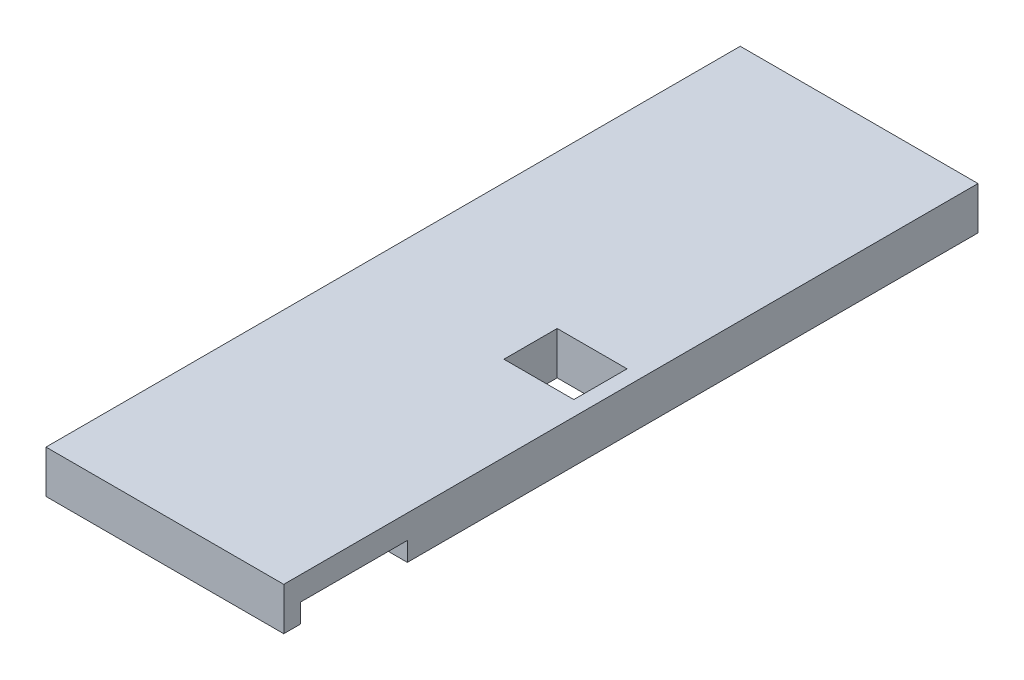
ISO-10303-21;
HEADER;
FILE_DESCRIPTION(('STEP AP214'),'2;1');
FILE_NAME('part.step','',(''),(''),'','','');
FILE_SCHEMA(('AUTOMOTIVE_DESIGN { 1 0 10303 214 1 1 1 1 }'));
ENDSEC;
DATA;
#1=APPLICATION_CONTEXT('core data for automotive mechanical design processes');
#2=APPLICATION_PROTOCOL_DEFINITION('international standard','automotive_design',2000,#1);
#3=PRODUCT_CONTEXT('',#1,'mechanical');
#4=PRODUCT('Part','Part','',(#3));
#5=PRODUCT_RELATED_PRODUCT_CATEGORY('part','',(#4));
#6=PRODUCT_DEFINITION_FORMATION('','',#4);
#7=PRODUCT_DEFINITION_CONTEXT('part definition',#1,'design');
#8=PRODUCT_DEFINITION('design','',#6,#7);
#9=PRODUCT_DEFINITION_SHAPE('','',#8);
#10=(LENGTH_UNIT() NAMED_UNIT(*) SI_UNIT(.MILLI.,.METRE.));
#11=(NAMED_UNIT(*) PLANE_ANGLE_UNIT() SI_UNIT($,.RADIAN.));
#12=(NAMED_UNIT(*) SI_UNIT($,.STERADIAN.) SOLID_ANGLE_UNIT());
#13=UNCERTAINTY_MEASURE_WITH_UNIT(LENGTH_MEASURE(1.E-05),#10,'distance_accuracy_value','');
#14=(GEOMETRIC_REPRESENTATION_CONTEXT(3) GLOBAL_UNCERTAINTY_ASSIGNED_CONTEXT((#13)) GLOBAL_UNIT_ASSIGNED_CONTEXT((#10,
#11,#12)) REPRESENTATION_CONTEXT('',''));
#15=CARTESIAN_POINT('',(0.,0.,0.));
#16=DIRECTION('',(0.,0.,1.));
#17=DIRECTION('',(1.,0.,0.));
#18=AXIS2_PLACEMENT_3D('',#15,#16,#17);
#19=CARTESIAN_POINT('',(50.,9.,146.));
#20=DIRECTION('',(-1.,0.,0.));
#21=DIRECTION('',(0.,0.,1.));
#22=AXIS2_PLACEMENT_3D('',#19,#20,#21);
#23=PLANE('',#22);
#24=DIRECTION('',(0.,0.,-1.));
#25=VECTOR('',#24,1.);
#26=CARTESIAN_POINT('',(50.,-9.,146.));
#27=LINE('',#26,#25);
#28=CARTESIAN_POINT('',(50.,-9.,146.));
#29=VERTEX_POINT('',#28);
#30=CARTESIAN_POINT('',(50.,-9.,139.021105826968));
#31=VERTEX_POINT('',#30);
#32=EDGE_CURVE('E203',#29,#31,#27,.T.);
#33=ORIENTED_EDGE('',*,*,#32,.T.);
#34=DIRECTION('',(0.,-1.,0.));
#35=VECTOR('',#34,1.);
#36=CARTESIAN_POINT('',(50.,-0.999999999999999,139.021105826968));
#37=LINE('',#36,#35);
#38=CARTESIAN_POINT('',(50.,-0.999999999999999,139.021105826968));
#39=VERTEX_POINT('',#38);
#40=EDGE_CURVE('E159',#39,#31,#37,.T.);
#41=ORIENTED_EDGE('',*,*,#40,.F.);
#42=DIRECTION('',(0.,0.,1.));
#43=VECTOR('',#42,1.);
#44=CARTESIAN_POINT('',(50.,-0.999999999999999,94.0211058269679));
#45=LINE('',#44,#43);
#46=CARTESIAN_POINT('',(50.,-0.999999999999999,94.0211058269679));
#47=VERTEX_POINT('',#46);
#48=EDGE_CURVE('E142',#47,#39,#45,.T.);
#49=ORIENTED_EDGE('',*,*,#48,.F.);
#50=DIRECTION('',(0.,-1.,0.));
#51=VECTOR('',#50,1.);
#52=CARTESIAN_POINT('',(50.,-0.999999999999999,94.0211058269679));
#53=LINE('',#52,#51);
#54=CARTESIAN_POINT('',(50.,-9.,94.0211058269679));
#55=VERTEX_POINT('',#54);
#56=EDGE_CURVE('E133',#47,#55,#53,.T.);
#57=ORIENTED_EDGE('',*,*,#56,.T.);
#58=CARTESIAN_POINT('',(50.,-9.,-146.));
#59=VERTEX_POINT('',#58);
#60=EDGE_CURVE('E185',#55,#59,#27,.T.);
#61=ORIENTED_EDGE('',*,*,#60,.T.);
#62=DIRECTION('',(0.,-1.,0.));
#63=VECTOR('',#62,1.);
#64=CARTESIAN_POINT('',(50.,9.,-146.));
#65=LINE('',#64,#63);
#66=CARTESIAN_POINT('',(50.,9.,-146.));
#67=VERTEX_POINT('',#66);
#68=EDGE_CURVE('E11',#67,#59,#65,.T.);
#69=ORIENTED_EDGE('',*,*,#68,.F.);
#70=DIRECTION('',(0.,0.,-1.));
#71=VECTOR('',#70,1.);
#72=CARTESIAN_POINT('',(50.,9.,146.));
#73=LINE('',#72,#71);
#74=CARTESIAN_POINT('',(50.,9.,146.));
#75=VERTEX_POINT('',#74);
#76=EDGE_CURVE('E192',#75,#67,#73,.T.);
#77=ORIENTED_EDGE('',*,*,#76,.F.);
#78=DIRECTION('',(0.,-1.,0.));
#79=VECTOR('',#78,1.);
#80=CARTESIAN_POINT('',(50.,9.,146.));
#81=LINE('',#80,#79);
#82=EDGE_CURVE('E202',#75,#29,#81,.T.);
#83=ORIENTED_EDGE('',*,*,#82,.T.);
#84=EDGE_LOOP('',(#33,#41,#49,#57,#61,#69,#77,#83));
#85=FACE_BOUND('',#84,.T.);
#86=ADVANCED_FACE('F39',(#85),#23,.F.);
#87=CARTESIAN_POINT('',(-50.,9.,-146.));
#88=DIRECTION('',(0.,0.,1.));
#89=DIRECTION('',(1.,0.,0.));
#90=AXIS2_PLACEMENT_3D('',#87,#88,#89);
#91=PLANE('',#90);
#92=DIRECTION('',(-1.,0.,0.));
#93=VECTOR('',#92,1.);
#94=CARTESIAN_POINT('',(-50.,-9.,-146.));
#95=LINE('',#94,#93);
#96=CARTESIAN_POINT('',(-50.,-9.,-146.));
#97=VERTEX_POINT('',#96);
#98=EDGE_CURVE('E206',#59,#97,#95,.T.);
#99=ORIENTED_EDGE('',*,*,#98,.T.);
#100=DIRECTION('',(0.,-1.,0.));
#101=VECTOR('',#100,1.);
#102=CARTESIAN_POINT('',(-50.,9.,-146.));
#103=LINE('',#102,#101);
#104=CARTESIAN_POINT('',(-50.,9.,-146.));
#105=VERTEX_POINT('',#104);
#106=EDGE_CURVE('E46',#105,#97,#103,.T.);
#107=ORIENTED_EDGE('',*,*,#106,.F.);
#108=DIRECTION('',(-1.,0.,0.));
#109=VECTOR('',#108,1.);
#110=CARTESIAN_POINT('',(-50.,9.,-146.));
#111=LINE('',#110,#109);
#112=EDGE_CURVE('E195',#67,#105,#111,.T.);
#113=ORIENTED_EDGE('',*,*,#112,.F.);
#114=ORIENTED_EDGE('',*,*,#68,.T.);
#115=EDGE_LOOP('',(#99,#107,#113,#114));
#116=FACE_BOUND('',#115,.T.);
#117=ADVANCED_FACE('F241',(#116),#91,.F.);
#118=CARTESIAN_POINT('',(-50.,9.,146.));
#119=DIRECTION('',(1.,0.,0.));
#120=DIRECTION('',(0.,0.,-1.));
#121=AXIS2_PLACEMENT_3D('',#118,#119,#120);
#122=PLANE('',#121);
#123=DIRECTION('',(0.,0.,1.));
#124=VECTOR('',#123,1.);
#125=CARTESIAN_POINT('',(-50.,-9.,146.));
#126=LINE('',#125,#124);
#127=CARTESIAN_POINT('',(-50.,-9.,146.));
#128=VERTEX_POINT('',#127);
#129=EDGE_CURVE('E208',#97,#128,#126,.T.);
#130=ORIENTED_EDGE('',*,*,#129,.T.);
#131=DIRECTION('',(0.,-1.,0.));
#132=VECTOR('',#131,1.);
#133=CARTESIAN_POINT('',(-50.,9.,146.));
#134=LINE('',#133,#132);
#135=CARTESIAN_POINT('',(-50.,9.,146.));
#136=VERTEX_POINT('',#135);
#137=EDGE_CURVE('E213',#136,#128,#134,.T.);
#138=ORIENTED_EDGE('',*,*,#137,.F.);
#139=DIRECTION('',(0.,0.,1.));
#140=VECTOR('',#139,1.);
#141=CARTESIAN_POINT('',(-50.,9.,146.));
#142=LINE('',#141,#140);
#143=EDGE_CURVE('E198',#105,#136,#142,.T.);
#144=ORIENTED_EDGE('',*,*,#143,.F.);
#145=ORIENTED_EDGE('',*,*,#106,.T.);
#146=EDGE_LOOP('',(#130,#138,#144,#145));
#147=FACE_BOUND('',#146,.T.);
#148=ADVANCED_FACE('F220',(#147),#122,.F.);
#149=CARTESIAN_POINT('',(-50.,9.,146.));
#150=DIRECTION('',(0.,0.,-1.));
#151=DIRECTION('',(-1.,0.,0.));
#152=AXIS2_PLACEMENT_3D('',#149,#150,#151);
#153=PLANE('',#152);
#154=DIRECTION('',(1.,0.,0.));
#155=VECTOR('',#154,1.);
#156=CARTESIAN_POINT('',(-50.,-9.,146.));
#157=LINE('',#156,#155);
#158=EDGE_CURVE('E196',#128,#29,#157,.T.);
#159=ORIENTED_EDGE('',*,*,#158,.T.);
#160=ORIENTED_EDGE('',*,*,#82,.F.);
#161=DIRECTION('',(1.,0.,0.));
#162=VECTOR('',#161,1.);
#163=CARTESIAN_POINT('',(-50.,9.,146.));
#164=LINE('',#163,#162);
#165=EDGE_CURVE('E200',#136,#75,#164,.T.);
#166=ORIENTED_EDGE('',*,*,#165,.F.);
#167=ORIENTED_EDGE('',*,*,#137,.T.);
#168=EDGE_LOOP('',(#159,#160,#166,#167));
#169=FACE_BOUND('',#168,.T.);
#170=ADVANCED_FACE('F233',(#169),#153,.F.);
#171=CARTESIAN_POINT('',(0.,9.,0.));
#172=DIRECTION('',(0.,-1.,0.));
#173=DIRECTION('',(0.,0.,-1.));
#174=AXIS2_PLACEMENT_3D('',#171,#172,#173);
#175=PLANE('',#174);
#176=DIRECTION('',(0.,0.,-1.));
#177=VECTOR('',#176,1.);
#178=CARTESIAN_POINT('',(14.3,9.,17.7));
#179=LINE('',#178,#177);
#180=CARTESIAN_POINT('',(14.3,9.,17.7));
#181=VERTEX_POINT('',#180);
#182=CARTESIAN_POINT('',(14.3,9.,-4.69999999999997));
#183=VERTEX_POINT('',#182);
#184=EDGE_CURVE('E170',#181,#183,#179,.T.);
#185=ORIENTED_EDGE('',*,*,#184,.T.);
#186=DIRECTION('',(1.,0.,0.));
#187=VECTOR('',#186,1.);
#188=CARTESIAN_POINT('',(14.3,9.,-4.69999999999997));
#189=LINE('',#188,#187);
#190=CARTESIAN_POINT('',(43.7,9.,-4.69999999999996));
#191=VERTEX_POINT('',#190);
#192=EDGE_CURVE('E162',#183,#191,#189,.T.);
#193=ORIENTED_EDGE('',*,*,#192,.T.);
#194=DIRECTION('',(0.,0.,1.));
#195=VECTOR('',#194,1.);
#196=CARTESIAN_POINT('',(43.7,9.,-4.69999999999996));
#197=LINE('',#196,#195);
#198=CARTESIAN_POINT('',(43.7,9.,17.7));
#199=VERTEX_POINT('',#198);
#200=EDGE_CURVE('E165',#191,#199,#197,.T.);
#201=ORIENTED_EDGE('',*,*,#200,.T.);
#202=DIRECTION('',(-1.,0.,0.));
#203=VECTOR('',#202,1.);
#204=CARTESIAN_POINT('',(43.7,9.,17.7));
#205=LINE('',#204,#203);
#206=EDGE_CURVE('E61',#199,#181,#205,.T.);
#207=ORIENTED_EDGE('',*,*,#206,.T.);
#208=EDGE_LOOP('',(#185,#193,#201,#207));
#209=FACE_BOUND('',#208,.T.);
#210=ORIENTED_EDGE('',*,*,#76,.T.);
#211=ORIENTED_EDGE('',*,*,#112,.T.);
#212=ORIENTED_EDGE('',*,*,#143,.T.);
#213=ORIENTED_EDGE('',*,*,#165,.T.);
#214=EDGE_LOOP('',(#210,#211,#212,#213));
#215=FACE_BOUND('',#214,.T.);
#216=ADVANCED_FACE('F240',(#209,#215),#175,.F.);
#217=CARTESIAN_POINT('',(0.,-9.,0.));
#218=DIRECTION('',(0.,-1.,0.));
#219=DIRECTION('',(0.,0.,-1.));
#220=AXIS2_PLACEMENT_3D('',#217,#218,#219);
#221=PLANE('',#220);
#222=DIRECTION('',(-1.,0.,0.));
#223=VECTOR('',#222,1.);
#224=CARTESIAN_POINT('',(36.5,-9.,139.021105826968));
#225=LINE('',#224,#223);
#226=CARTESIAN_POINT('',(36.5,-9.,139.021105826968));
#227=VERTEX_POINT('',#226);
#228=EDGE_CURVE('E146',#31,#227,#225,.T.);
#229=ORIENTED_EDGE('',*,*,#228,.F.);
#230=ORIENTED_EDGE('',*,*,#32,.F.);
#231=ORIENTED_EDGE('',*,*,#158,.F.);
#232=ORIENTED_EDGE('',*,*,#129,.F.);
#233=ORIENTED_EDGE('',*,*,#98,.F.);
#234=ORIENTED_EDGE('',*,*,#60,.F.);
#235=DIRECTION('',(1.,0.,0.));
#236=VECTOR('',#235,1.);
#237=CARTESIAN_POINT('',(36.5,-9.,94.0211058269679));
#238=LINE('',#237,#236);
#239=CARTESIAN_POINT('',(36.5,-9.,94.0211058269679));
#240=VERTEX_POINT('',#239);
#241=EDGE_CURVE('E149',#240,#55,#238,.T.);
#242=ORIENTED_EDGE('',*,*,#241,.F.);
#243=DIRECTION('',(0.,0.,-1.));
#244=VECTOR('',#243,1.);
#245=CARTESIAN_POINT('',(36.5,-9.,94.0211058269679));
#246=LINE('',#245,#244);
#247=EDGE_CURVE('E53',#227,#240,#246,.T.);
#248=ORIENTED_EDGE('',*,*,#247,.F.);
#249=EDGE_LOOP('',(#229,#230,#231,#232,#233,#234,#242,#248));
#250=FACE_BOUND('',#249,.T.);
#251=DIRECTION('',(1.,0.,0.));
#252=VECTOR('',#251,1.);
#253=CARTESIAN_POINT('',(14.3,-9.,-4.69999999999997));
#254=LINE('',#253,#252);
#255=CARTESIAN_POINT('',(14.3,-9.,-4.69999999999997));
#256=VERTEX_POINT('',#255);
#257=CARTESIAN_POINT('',(43.7,-9.,-4.69999999999996));
#258=VERTEX_POINT('',#257);
#259=EDGE_CURVE('E158',#256,#258,#254,.T.);
#260=ORIENTED_EDGE('',*,*,#259,.F.);
#261=DIRECTION('',(0.,0.,-1.));
#262=VECTOR('',#261,1.);
#263=CARTESIAN_POINT('',(14.3,-9.,17.7));
#264=LINE('',#263,#262);
#265=CARTESIAN_POINT('',(14.3,-9.,17.7));
#266=VERTEX_POINT('',#265);
#267=EDGE_CURVE('E166',#266,#256,#264,.T.);
#268=ORIENTED_EDGE('',*,*,#267,.F.);
#269=DIRECTION('',(-1.,0.,0.));
#270=VECTOR('',#269,1.);
#271=CARTESIAN_POINT('',(43.7,-9.,17.7));
#272=LINE('',#271,#270);
#273=CARTESIAN_POINT('',(43.7,-9.,17.7));
#274=VERTEX_POINT('',#273);
#275=EDGE_CURVE('E178',#274,#266,#272,.T.);
#276=ORIENTED_EDGE('',*,*,#275,.F.);
#277=DIRECTION('',(0.,0.,1.));
#278=VECTOR('',#277,1.);
#279=CARTESIAN_POINT('',(43.7,-9.,-4.69999999999996));
#280=LINE('',#279,#278);
#281=EDGE_CURVE('E175',#258,#274,#280,.T.);
#282=ORIENTED_EDGE('',*,*,#281,.F.);
#283=EDGE_LOOP('',(#260,#268,#276,#282));
#284=FACE_BOUND('',#283,.T.);
#285=ADVANCED_FACE('F227',(#250,#284),#221,.T.);
#286=CARTESIAN_POINT('',(14.3,9.,-4.69999999999997));
#287=DIRECTION('',(0.,0.,-1.));
#288=DIRECTION('',(-1.,0.,0.));
#289=AXIS2_PLACEMENT_3D('',#286,#287,#288);
#290=PLANE('',#289);
#291=ORIENTED_EDGE('',*,*,#259,.T.);
#292=DIRECTION('',(0.,-1.,0.));
#293=VECTOR('',#292,1.);
#294=CARTESIAN_POINT('',(43.7,9.,-4.69999999999996));
#295=LINE('',#294,#293);
#296=EDGE_CURVE('E173',#191,#258,#295,.T.);
#297=ORIENTED_EDGE('',*,*,#296,.F.);
#298=ORIENTED_EDGE('',*,*,#192,.F.);
#299=DIRECTION('',(0.,-1.,0.));
#300=VECTOR('',#299,1.);
#301=CARTESIAN_POINT('',(14.3,9.,-4.69999999999997));
#302=LINE('',#301,#300);
#303=EDGE_CURVE('E183',#183,#256,#302,.T.);
#304=ORIENTED_EDGE('',*,*,#303,.T.);
#305=EDGE_LOOP('',(#291,#297,#298,#304));
#306=FACE_BOUND('',#305,.T.);
#307=ADVANCED_FACE('F253',(#306),#290,.F.);
#308=CARTESIAN_POINT('',(14.3,9.,17.7));
#309=DIRECTION('',(-1.,0.,0.));
#310=DIRECTION('',(0.,0.,1.));
#311=AXIS2_PLACEMENT_3D('',#308,#309,#310);
#312=PLANE('',#311);
#313=ORIENTED_EDGE('',*,*,#267,.T.);
#314=ORIENTED_EDGE('',*,*,#303,.F.);
#315=ORIENTED_EDGE('',*,*,#184,.F.);
#316=DIRECTION('',(0.,-1.,0.));
#317=VECTOR('',#316,1.);
#318=CARTESIAN_POINT('',(14.3,9.,17.7));
#319=LINE('',#318,#317);
#320=EDGE_CURVE('E186',#181,#266,#319,.T.);
#321=ORIENTED_EDGE('',*,*,#320,.T.);
#322=EDGE_LOOP('',(#313,#314,#315,#321));
#323=FACE_BOUND('',#322,.T.);
#324=ADVANCED_FACE('F259',(#323),#312,.F.);
#325=CARTESIAN_POINT('',(43.7,9.,17.7));
#326=DIRECTION('',(0.,0.,1.));
#327=DIRECTION('',(1.,0.,0.));
#328=AXIS2_PLACEMENT_3D('',#325,#326,#327);
#329=PLANE('',#328);
#330=ORIENTED_EDGE('',*,*,#275,.T.);
#331=ORIENTED_EDGE('',*,*,#320,.F.);
#332=ORIENTED_EDGE('',*,*,#206,.F.);
#333=DIRECTION('',(0.,-1.,0.));
#334=VECTOR('',#333,1.);
#335=CARTESIAN_POINT('',(43.7,9.,17.7));
#336=LINE('',#335,#334);
#337=EDGE_CURVE('E188',#199,#274,#336,.T.);
#338=ORIENTED_EDGE('',*,*,#337,.T.);
#339=EDGE_LOOP('',(#330,#331,#332,#338));
#340=FACE_BOUND('',#339,.T.);
#341=ADVANCED_FACE('F264',(#340),#329,.F.);
#342=CARTESIAN_POINT('',(43.7,9.,-4.69999999999996));
#343=DIRECTION('',(1.,0.,0.));
#344=DIRECTION('',(0.,0.,-1.));
#345=AXIS2_PLACEMENT_3D('',#342,#343,#344);
#346=PLANE('',#345);
#347=ORIENTED_EDGE('',*,*,#281,.T.);
#348=ORIENTED_EDGE('',*,*,#337,.F.);
#349=ORIENTED_EDGE('',*,*,#200,.F.);
#350=ORIENTED_EDGE('',*,*,#296,.T.);
#351=EDGE_LOOP('',(#347,#348,#349,#350));
#352=FACE_BOUND('',#351,.T.);
#353=ADVANCED_FACE('F261',(#352),#346,.F.);
#354=CARTESIAN_POINT('',(36.5,-0.999999999999999,94.0211058269679));
#355=DIRECTION('',(-1.,0.,0.));
#356=DIRECTION('',(0.,0.,1.));
#357=AXIS2_PLACEMENT_3D('',#354,#355,#356);
#358=PLANE('',#357);
#359=ORIENTED_EDGE('',*,*,#247,.T.);
#360=DIRECTION('',(0.,-1.,0.));
#361=VECTOR('',#360,1.);
#362=CARTESIAN_POINT('',(36.5,-0.999999999999999,94.0211058269679));
#363=LINE('',#362,#361);
#364=CARTESIAN_POINT('',(36.5,-0.999999999999999,94.0211058269679));
#365=VERTEX_POINT('',#364);
#366=EDGE_CURVE('E125',#365,#240,#363,.T.);
#367=ORIENTED_EDGE('',*,*,#366,.F.);
#368=DIRECTION('',(0.,0.,-1.));
#369=VECTOR('',#368,1.);
#370=CARTESIAN_POINT('',(36.5,-0.999999999999999,94.0211058269679));
#371=LINE('',#370,#369);
#372=CARTESIAN_POINT('',(36.5,-0.999999999999999,139.021105826968));
#373=VERTEX_POINT('',#372);
#374=EDGE_CURVE('E129',#373,#365,#371,.T.);
#375=ORIENTED_EDGE('',*,*,#374,.F.);
#376=DIRECTION('',(0.,-1.,0.));
#377=VECTOR('',#376,1.);
#378=CARTESIAN_POINT('',(36.5,-0.999999999999999,139.021105826968));
#379=LINE('',#378,#377);
#380=EDGE_CURVE('E156',#373,#227,#379,.T.);
#381=ORIENTED_EDGE('',*,*,#380,.T.);
#382=EDGE_LOOP('',(#359,#367,#375,#381));
#383=FACE_BOUND('',#382,.T.);
#384=ADVANCED_FACE('F127',(#383),#358,.F.);
#385=CARTESIAN_POINT('',(36.5,-0.999999999999999,139.021105826968));
#386=DIRECTION('',(0.,0.,1.));
#387=DIRECTION('',(1.,0.,0.));
#388=AXIS2_PLACEMENT_3D('',#385,#386,#387);
#389=PLANE('',#388);
#390=ORIENTED_EDGE('',*,*,#228,.T.);
#391=ORIENTED_EDGE('',*,*,#380,.F.);
#392=DIRECTION('',(-1.,0.,0.));
#393=VECTOR('',#392,1.);
#394=CARTESIAN_POINT('',(36.5,-0.999999999999999,139.021105826968));
#395=LINE('',#394,#393);
#396=EDGE_CURVE('E134',#39,#373,#395,.T.);
#397=ORIENTED_EDGE('',*,*,#396,.F.);
#398=ORIENTED_EDGE('',*,*,#40,.T.);
#399=EDGE_LOOP('',(#390,#391,#397,#398));
#400=FACE_BOUND('',#399,.T.);
#401=ADVANCED_FACE('F273',(#400),#389,.F.);
#402=CARTESIAN_POINT('',(36.5,-0.999999999999999,94.0211058269679));
#403=DIRECTION('',(0.,0.,-1.));
#404=DIRECTION('',(-1.,0.,0.));
#405=AXIS2_PLACEMENT_3D('',#402,#403,#404);
#406=PLANE('',#405);
#407=ORIENTED_EDGE('',*,*,#241,.T.);
#408=ORIENTED_EDGE('',*,*,#56,.F.);
#409=DIRECTION('',(1.,0.,0.));
#410=VECTOR('',#409,1.);
#411=CARTESIAN_POINT('',(36.5,-0.999999999999999,94.0211058269679));
#412=LINE('',#411,#410);
#413=EDGE_CURVE('E137',#365,#47,#412,.T.);
#414=ORIENTED_EDGE('',*,*,#413,.F.);
#415=ORIENTED_EDGE('',*,*,#366,.T.);
#416=EDGE_LOOP('',(#407,#408,#414,#415));
#417=FACE_BOUND('',#416,.T.);
#418=ADVANCED_FACE('F138',(#417),#406,.F.);
#419=CARTESIAN_POINT('',(0.,-0.999999999999999,0.));
#420=DIRECTION('',(0.,1.,0.));
#421=DIRECTION('',(0.,0.,1.));
#422=AXIS2_PLACEMENT_3D('',#419,#420,#421);
#423=PLANE('',#422);
#424=ORIENTED_EDGE('',*,*,#374,.T.);
#425=ORIENTED_EDGE('',*,*,#413,.T.);
#426=ORIENTED_EDGE('',*,*,#48,.T.);
#427=ORIENTED_EDGE('',*,*,#396,.T.);
#428=EDGE_LOOP('',(#424,#425,#426,#427));
#429=FACE_BOUND('',#428,.T.);
#430=ADVANCED_FACE('F144',(#429),#423,.F.);
#431=CLOSED_SHELL('',(#86,#117,#148,#170,#216,#285,#307,#324,#341,#353,#384,#401,#418,#430));
#432=MANIFOLD_SOLID_BREP('B2',#431);
#433=ADVANCED_BREP_SHAPE_REPRESENTATION('',(#18,#432),#14);
#434=SHAPE_DEFINITION_REPRESENTATION(#9,#433);
ENDSEC;
END-ISO-10303-21;
